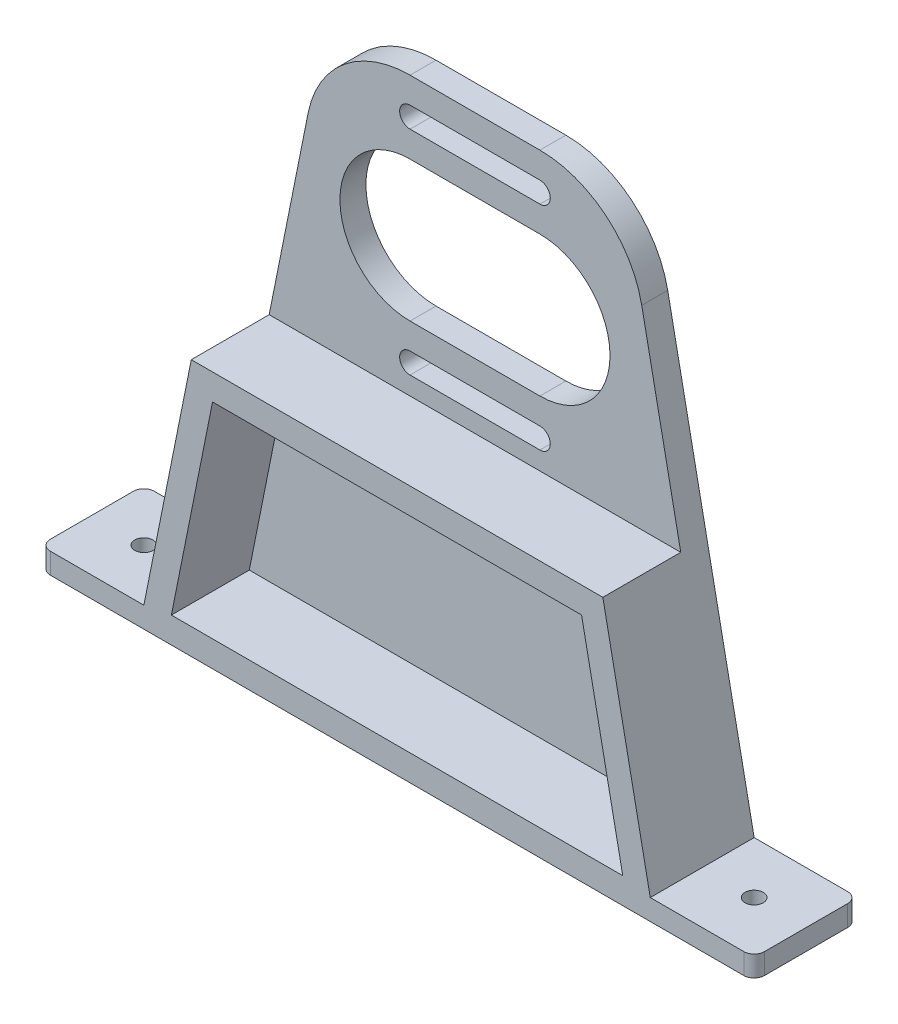
ISO-10303-21;
HEADER;
FILE_DESCRIPTION(('STEP AP214'),'2;1');
FILE_NAME('part.step','',(''),(''),'','','');
FILE_SCHEMA(('AUTOMOTIVE_DESIGN { 1 0 10303 214 1 1 1 1 }'));
ENDSEC;
DATA;
#1=APPLICATION_CONTEXT('core data for automotive mechanical design processes');
#2=APPLICATION_PROTOCOL_DEFINITION('international standard','automotive_design',2000,#1);
#3=PRODUCT_CONTEXT('',#1,'mechanical');
#4=PRODUCT('Part','Part','',(#3));
#5=PRODUCT_RELATED_PRODUCT_CATEGORY('part','',(#4));
#6=PRODUCT_DEFINITION_FORMATION('','',#4);
#7=PRODUCT_DEFINITION_CONTEXT('part definition',#1,'design');
#8=PRODUCT_DEFINITION('design','',#6,#7);
#9=PRODUCT_DEFINITION_SHAPE('','',#8);
#10=(LENGTH_UNIT() NAMED_UNIT(*) SI_UNIT(.MILLI.,.METRE.));
#11=(NAMED_UNIT(*) PLANE_ANGLE_UNIT() SI_UNIT($,.RADIAN.));
#12=(NAMED_UNIT(*) SI_UNIT($,.STERADIAN.) SOLID_ANGLE_UNIT());
#13=UNCERTAINTY_MEASURE_WITH_UNIT(LENGTH_MEASURE(1.E-05),#10,'distance_accuracy_value','');
#14=(GEOMETRIC_REPRESENTATION_CONTEXT(3) GLOBAL_UNCERTAINTY_ASSIGNED_CONTEXT((#13)) GLOBAL_UNIT_ASSIGNED_CONTEXT((#10,
#11,#12)) REPRESENTATION_CONTEXT('',''));
#15=CARTESIAN_POINT('',(0.,0.,0.));
#16=DIRECTION('',(0.,0.,1.));
#17=DIRECTION('',(1.,0.,0.));
#18=AXIS2_PLACEMENT_3D('',#15,#16,#17);
#19=CARTESIAN_POINT('',(-12.5,83.,5.));
#20=DIRECTION('',(0.,0.,-1.));
#21=DIRECTION('',(-1.,0.,0.));
#22=AXIS2_PLACEMENT_3D('',#19,#20,#21);
#23=PLANE('',#22);
#24=CARTESIAN_POINT('',(-12.5,75.5,5.));
#25=DIRECTION('',(0.,0.,1.));
#26=DIRECTION('',(1.,0.,0.));
#27=AXIS2_PLACEMENT_3D('',#24,#25,#26);
#28=CIRCLE('',#27,13.5);
#29=CARTESIAN_POINT('',(-12.5,89.,5.));
#30=VERTEX_POINT('',#29);
#31=CARTESIAN_POINT('',(-12.5,62.,5.));
#32=VERTEX_POINT('',#31);
#33=EDGE_CURVE('E351',#30,#32,#28,.T.);
#34=ORIENTED_EDGE('',*,*,#33,.F.);
#35=DIRECTION('',(-1.,0.,0.));
#36=VECTOR('',#35,1.);
#37=CARTESIAN_POINT('',(-12.5,89.,5.));
#38=LINE('',#37,#36);
#39=CARTESIAN_POINT('',(12.5,89.,5.));
#40=VERTEX_POINT('',#39);
#41=EDGE_CURVE('E362',#40,#30,#38,.T.);
#42=ORIENTED_EDGE('',*,*,#41,.F.);
#43=CARTESIAN_POINT('',(12.5,75.5,5.));
#44=DIRECTION('',(0.,0.,1.));
#45=DIRECTION('',(1.,0.,0.));
#46=AXIS2_PLACEMENT_3D('',#43,#44,#45);
#47=CIRCLE('',#46,13.5);
#48=CARTESIAN_POINT('',(12.5,62.,5.));
#49=VERTEX_POINT('',#48);
#50=EDGE_CURVE('E358',#49,#40,#47,.T.);
#51=ORIENTED_EDGE('',*,*,#50,.F.);
#52=DIRECTION('',(1.,0.,0.));
#53=VECTOR('',#52,1.);
#54=CARTESIAN_POINT('',(-12.5,62.,5.));
#55=LINE('',#54,#53);
#56=EDGE_CURVE('E354',#32,#49,#55,.T.);
#57=ORIENTED_EDGE('',*,*,#56,.F.);
#58=EDGE_LOOP('',(#34,#42,#51,#57));
#59=FACE_BOUND('',#58,.T.);
#60=CARTESIAN_POINT('',(-12.5,96.,5.));
#61=DIRECTION('',(0.,0.,1.));
#62=DIRECTION('',(1.,0.,0.));
#63=AXIS2_PLACEMENT_3D('',#60,#61,#62);
#64=CIRCLE('',#63,2.);
#65=CARTESIAN_POINT('',(-12.5,98.,5.));
#66=VERTEX_POINT('',#65);
#67=CARTESIAN_POINT('',(-12.5,94.,5.));
#68=VERTEX_POINT('',#67);
#69=EDGE_CURVE('E394',#66,#68,#64,.T.);
#70=ORIENTED_EDGE('',*,*,#69,.F.);
#71=DIRECTION('',(-1.,0.,0.));
#72=VECTOR('',#71,1.);
#73=CARTESIAN_POINT('',(-12.5,98.,5.));
#74=LINE('',#73,#72);
#75=CARTESIAN_POINT('',(12.5,98.,5.));
#76=VERTEX_POINT('',#75);
#77=EDGE_CURVE('E405',#76,#66,#74,.T.);
#78=ORIENTED_EDGE('',*,*,#77,.F.);
#79=CARTESIAN_POINT('',(12.5,96.,5.));
#80=DIRECTION('',(0.,0.,1.));
#81=DIRECTION('',(1.,0.,0.));
#82=AXIS2_PLACEMENT_3D('',#79,#80,#81);
#83=CIRCLE('',#82,2.);
#84=CARTESIAN_POINT('',(12.5,94.,5.));
#85=VERTEX_POINT('',#84);
#86=EDGE_CURVE('E401',#85,#76,#83,.T.);
#87=ORIENTED_EDGE('',*,*,#86,.F.);
#88=DIRECTION('',(1.,0.,0.));
#89=VECTOR('',#88,1.);
#90=CARTESIAN_POINT('',(-12.5,94.,5.));
#91=LINE('',#90,#89);
#92=EDGE_CURVE('E397',#68,#85,#91,.T.);
#93=ORIENTED_EDGE('',*,*,#92,.F.);
#94=EDGE_LOOP('',(#70,#78,#87,#93));
#95=FACE_BOUND('',#94,.T.);
#96=CARTESIAN_POINT('',(-12.5,55.,5.));
#97=DIRECTION('',(0.,0.,1.));
#98=DIRECTION('',(1.,0.,0.));
#99=AXIS2_PLACEMENT_3D('',#96,#97,#98);
#100=CIRCLE('',#99,2.);
#101=CARTESIAN_POINT('',(-12.5,57.,5.));
#102=VERTEX_POINT('',#101);
#103=CARTESIAN_POINT('',(-12.5,53.,5.));
#104=VERTEX_POINT('',#103);
#105=EDGE_CURVE('E308',#102,#104,#100,.T.);
#106=ORIENTED_EDGE('',*,*,#105,.F.);
#107=DIRECTION('',(-1.,0.,0.));
#108=VECTOR('',#107,1.);
#109=CARTESIAN_POINT('',(-12.5,57.,5.));
#110=LINE('',#109,#108);
#111=CARTESIAN_POINT('',(12.5,57.,5.));
#112=VERTEX_POINT('',#111);
#113=EDGE_CURVE('E319',#112,#102,#110,.T.);
#114=ORIENTED_EDGE('',*,*,#113,.F.);
#115=CARTESIAN_POINT('',(12.5,55.,5.));
#116=DIRECTION('',(0.,0.,1.));
#117=DIRECTION('',(1.,0.,0.));
#118=AXIS2_PLACEMENT_3D('',#115,#116,#117);
#119=CIRCLE('',#118,2.);
#120=CARTESIAN_POINT('',(12.5,53.,5.));
#121=VERTEX_POINT('',#120);
#122=EDGE_CURVE('E315',#121,#112,#119,.T.);
#123=ORIENTED_EDGE('',*,*,#122,.F.);
#124=DIRECTION('',(1.,0.,0.));
#125=VECTOR('',#124,1.);
#126=CARTESIAN_POINT('',(-12.5,53.,5.));
#127=LINE('',#126,#125);
#128=EDGE_CURVE('E311',#104,#121,#127,.T.);
#129=ORIENTED_EDGE('',*,*,#128,.F.);
#130=EDGE_LOOP('',(#106,#114,#123,#129));
#131=FACE_BOUND('',#130,.T.);
#132=DIRECTION('',(-1.,0.,0.));
#133=VECTOR('',#132,1.);
#134=CARTESIAN_POINT('',(-39.6204148763501,49.5,5.));
#135=LINE('',#134,#133);
#136=CARTESIAN_POINT('',(39.6204148763502,49.5,5.));
#137=VERTEX_POINT('',#136);
#138=CARTESIAN_POINT('',(-39.6204148763501,49.5,5.));
#139=VERTEX_POINT('',#138);
#140=EDGE_CURVE('E295',#137,#139,#135,.T.);
#141=ORIENTED_EDGE('',*,*,#140,.F.);
#142=DIRECTION('',(-0.196729092755028,0.980457884900613,0.));
#143=VECTOR('',#142,1.);
#144=CARTESIAN_POINT('',(32.1091576980123,86.9345818551006,5.));
#145=LINE('',#144,#143);
#146=CARTESIAN_POINT('',(32.1091576980123,86.9345818551006,5.));
#147=VERTEX_POINT('',#146);
#148=EDGE_CURVE('E437',#137,#147,#145,.T.);
#149=ORIENTED_EDGE('',*,*,#148,.T.);
#150=CARTESIAN_POINT('',(12.5,83.,5.));
#151=DIRECTION('',(0.,0.,1.));
#152=DIRECTION('',(-1.,0.,0.));
#153=AXIS2_PLACEMENT_3D('',#150,#151,#152);
#154=CIRCLE('',#153,20.);
#155=CARTESIAN_POINT('',(12.5,103.,5.));
#156=VERTEX_POINT('',#155);
#157=EDGE_CURVE('E440',#147,#156,#154,.T.);
#158=ORIENTED_EDGE('',*,*,#157,.T.);
#159=DIRECTION('',(-1.,0.,0.));
#160=VECTOR('',#159,1.);
#161=CARTESIAN_POINT('',(-12.5,103.,5.));
#162=LINE('',#161,#160);
#163=CARTESIAN_POINT('',(-12.5,103.,5.));
#164=VERTEX_POINT('',#163);
#165=EDGE_CURVE('E444',#156,#164,#162,.T.);
#166=ORIENTED_EDGE('',*,*,#165,.T.);
#167=CARTESIAN_POINT('',(-12.5,83.,5.));
#168=DIRECTION('',(0.,0.,1.));
#169=DIRECTION('',(-1.,0.,0.));
#170=AXIS2_PLACEMENT_3D('',#167,#168,#169);
#171=CIRCLE('',#170,20.);
#172=CARTESIAN_POINT('',(-32.1091576980123,86.9345818551006,5.));
#173=VERTEX_POINT('',#172);
#174=EDGE_CURVE('E447',#164,#173,#171,.T.);
#175=ORIENTED_EDGE('',*,*,#174,.T.);
#176=DIRECTION('',(-0.196729092755028,-0.980457884900613,0.));
#177=VECTOR('',#176,1.);
#178=CARTESIAN_POINT('',(-48.75,4.,5.));
#179=LINE('',#178,#177);
#180=EDGE_CURVE('E450',#173,#139,#179,.T.);
#181=ORIENTED_EDGE('',*,*,#180,.T.);
#182=EDGE_LOOP('',(#141,#149,#158,#166,#175,#181));
#183=FACE_BOUND('',#182,.T.);
#184=ADVANCED_FACE('F43',(#59,#95,#131,#183),#23,.F.);
#185=CARTESIAN_POINT('',(-12.5,83.,0.));
#186=DIRECTION('',(0.,0.,-1.));
#187=DIRECTION('',(-1.,0.,0.));
#188=AXIS2_PLACEMENT_3D('',#185,#186,#187);
#189=PLANE('',#188);
#190=DIRECTION('',(1.,0.,0.));
#191=VECTOR('',#190,1.);
#192=CARTESIAN_POINT('',(-68.75,0.,0.));
#193=LINE('',#192,#191);
#194=CARTESIAN_POINT('',(-66.75,0.,0.));
#195=VERTEX_POINT('',#194);
#196=CARTESIAN_POINT('',(66.75,0.,0.));
#197=VERTEX_POINT('',#196);
#198=EDGE_CURVE('E436',#195,#197,#193,.T.);
#199=ORIENTED_EDGE('',*,*,#198,.F.);
#200=DIRECTION('',(0.,-1.,0.));
#201=VECTOR('',#200,1.);
#202=CARTESIAN_POINT('',(-66.75,4.00000000000001,0.));
#203=LINE('',#202,#201);
#204=CARTESIAN_POINT('',(-66.75,4.,0.));
#205=VERTEX_POINT('',#204);
#206=EDGE_CURVE('E12',#195,#205,#203,.F.);
#207=ORIENTED_EDGE('',*,*,#206,.T.);
#208=DIRECTION('',(-1.,0.,0.));
#209=VECTOR('',#208,1.);
#210=CARTESIAN_POINT('',(-68.75,4.,0.));
#211=LINE('',#210,#209);
#212=CARTESIAN_POINT('',(-48.75,4.,0.));
#213=VERTEX_POINT('',#212);
#214=EDGE_CURVE('E441',#213,#205,#211,.T.);
#215=ORIENTED_EDGE('',*,*,#214,.F.);
#216=DIRECTION('',(-0.196729092755028,-0.980457884900613,0.));
#217=VECTOR('',#216,1.);
#218=CARTESIAN_POINT('',(-48.75,4.,0.));
#219=LINE('',#218,#217);
#220=CARTESIAN_POINT('',(-32.1091576980123,86.9345818551006,0.));
#221=VERTEX_POINT('',#220);
#222=EDGE_CURVE('E471',#221,#213,#219,.T.);
#223=ORIENTED_EDGE('',*,*,#222,.F.);
#224=CARTESIAN_POINT('',(-12.5,83.,0.));
#225=DIRECTION('',(0.,0.,1.));
#226=DIRECTION('',(-1.,0.,0.));
#227=AXIS2_PLACEMENT_3D('',#224,#225,#226);
#228=CIRCLE('',#227,20.);
#229=CARTESIAN_POINT('',(-12.5,103.,0.));
#230=VERTEX_POINT('',#229);
#231=EDGE_CURVE('E468',#230,#221,#228,.T.);
#232=ORIENTED_EDGE('',*,*,#231,.F.);
#233=DIRECTION('',(-1.,0.,0.));
#234=VECTOR('',#233,1.);
#235=CARTESIAN_POINT('',(-12.5,103.,0.));
#236=LINE('',#235,#234);
#237=CARTESIAN_POINT('',(12.5,103.,0.));
#238=VERTEX_POINT('',#237);
#239=EDGE_CURVE('E465',#238,#230,#236,.T.);
#240=ORIENTED_EDGE('',*,*,#239,.F.);
#241=CARTESIAN_POINT('',(12.5,83.,0.));
#242=DIRECTION('',(0.,0.,1.));
#243=DIRECTION('',(-1.,0.,0.));
#244=AXIS2_PLACEMENT_3D('',#241,#242,#243);
#245=CIRCLE('',#244,20.);
#246=CARTESIAN_POINT('',(32.1091576980123,86.9345818551006,0.));
#247=VERTEX_POINT('',#246);
#248=EDGE_CURVE('E462',#247,#238,#245,.T.);
#249=ORIENTED_EDGE('',*,*,#248,.F.);
#250=DIRECTION('',(-0.196729092755028,0.980457884900613,0.));
#251=VECTOR('',#250,1.);
#252=CARTESIAN_POINT('',(32.1091576980123,86.9345818551006,0.));
#253=LINE('',#252,#251);
#254=CARTESIAN_POINT('',(48.75,4.,0.));
#255=VERTEX_POINT('',#254);
#256=EDGE_CURVE('E459',#255,#247,#253,.T.);
#257=ORIENTED_EDGE('',*,*,#256,.F.);
#258=DIRECTION('',(-1.,0.,0.));
#259=VECTOR('',#258,1.);
#260=CARTESIAN_POINT('',(48.75,4.,0.));
#261=LINE('',#260,#259);
#262=CARTESIAN_POINT('',(66.75,4.,0.));
#263=VERTEX_POINT('',#262);
#264=EDGE_CURVE('E260',#263,#255,#261,.T.);
#265=ORIENTED_EDGE('',*,*,#264,.F.);
#266=DIRECTION('',(0.,1.,0.));
#267=VECTOR('',#266,1.);
#268=CARTESIAN_POINT('',(66.75,0.,0.));
#269=LINE('',#268,#267);
#270=EDGE_CURVE('E52',#263,#197,#269,.F.);
#271=ORIENTED_EDGE('',*,*,#270,.T.);
#272=EDGE_LOOP('',(#199,#207,#215,#223,#232,#240,#249,#257,#265,#271));
#273=FACE_BOUND('',#272,.T.);
#274=DIRECTION('',(-1.,0.,0.));
#275=VECTOR('',#274,1.);
#276=CARTESIAN_POINT('',(-12.5,98.,0.));
#277=LINE('',#276,#275);
#278=CARTESIAN_POINT('',(12.5,98.,0.));
#279=VERTEX_POINT('',#278);
#280=CARTESIAN_POINT('',(-12.5,98.,0.));
#281=VERTEX_POINT('',#280);
#282=EDGE_CURVE('E398',#279,#281,#277,.T.);
#283=ORIENTED_EDGE('',*,*,#282,.T.);
#284=CARTESIAN_POINT('',(-12.5,96.,0.));
#285=DIRECTION('',(0.,0.,1.));
#286=DIRECTION('',(1.,0.,0.));
#287=AXIS2_PLACEMENT_3D('',#284,#285,#286);
#288=CIRCLE('',#287,2.);
#289=CARTESIAN_POINT('',(-12.5,94.,0.));
#290=VERTEX_POINT('',#289);
#291=EDGE_CURVE('E393',#281,#290,#288,.T.);
#292=ORIENTED_EDGE('',*,*,#291,.T.);
#293=DIRECTION('',(1.,0.,0.));
#294=VECTOR('',#293,1.);
#295=CARTESIAN_POINT('',(-12.5,94.,0.));
#296=LINE('',#295,#294);
#297=CARTESIAN_POINT('',(12.5,94.,0.));
#298=VERTEX_POINT('',#297);
#299=EDGE_CURVE('E412',#290,#298,#296,.T.);
#300=ORIENTED_EDGE('',*,*,#299,.T.);
#301=CARTESIAN_POINT('',(12.5,96.,0.));
#302=DIRECTION('',(0.,0.,1.));
#303=DIRECTION('',(1.,0.,0.));
#304=AXIS2_PLACEMENT_3D('',#301,#302,#303);
#305=CIRCLE('',#304,2.);
#306=EDGE_CURVE('E416',#298,#279,#305,.T.);
#307=ORIENTED_EDGE('',*,*,#306,.T.);
#308=EDGE_LOOP('',(#283,#292,#300,#307));
#309=FACE_BOUND('',#308,.T.);
#310=DIRECTION('',(-1.,0.,0.));
#311=VECTOR('',#310,1.);
#312=CARTESIAN_POINT('',(-12.5,89.,0.));
#313=LINE('',#312,#311);
#314=CARTESIAN_POINT('',(12.5,89.,0.));
#315=VERTEX_POINT('',#314);
#316=CARTESIAN_POINT('',(-12.5,89.,0.));
#317=VERTEX_POINT('',#316);
#318=EDGE_CURVE('E355',#315,#317,#313,.T.);
#319=ORIENTED_EDGE('',*,*,#318,.T.);
#320=CARTESIAN_POINT('',(-12.5,75.5,0.));
#321=DIRECTION('',(0.,0.,1.));
#322=DIRECTION('',(1.,0.,0.));
#323=AXIS2_PLACEMENT_3D('',#320,#321,#322);
#324=CIRCLE('',#323,13.5);
#325=CARTESIAN_POINT('',(-12.5,62.,0.));
#326=VERTEX_POINT('',#325);
#327=EDGE_CURVE('E350',#317,#326,#324,.T.);
#328=ORIENTED_EDGE('',*,*,#327,.T.);
#329=DIRECTION('',(1.,0.,0.));
#330=VECTOR('',#329,1.);
#331=CARTESIAN_POINT('',(-12.5,62.,0.));
#332=LINE('',#331,#330);
#333=CARTESIAN_POINT('',(12.5,62.,0.));
#334=VERTEX_POINT('',#333);
#335=EDGE_CURVE('E369',#326,#334,#332,.T.);
#336=ORIENTED_EDGE('',*,*,#335,.T.);
#337=CARTESIAN_POINT('',(12.5,75.5,0.));
#338=DIRECTION('',(0.,0.,1.));
#339=DIRECTION('',(1.,0.,0.));
#340=AXIS2_PLACEMENT_3D('',#337,#338,#339);
#341=CIRCLE('',#340,13.5);
#342=EDGE_CURVE('E373',#334,#315,#341,.T.);
#343=ORIENTED_EDGE('',*,*,#342,.T.);
#344=EDGE_LOOP('',(#319,#328,#336,#343));
#345=FACE_BOUND('',#344,.T.);
#346=DIRECTION('',(-1.,0.,0.));
#347=VECTOR('',#346,1.);
#348=CARTESIAN_POINT('',(-12.5,57.,0.));
#349=LINE('',#348,#347);
#350=CARTESIAN_POINT('',(12.5,57.,0.));
#351=VERTEX_POINT('',#350);
#352=CARTESIAN_POINT('',(-12.5,57.,0.));
#353=VERTEX_POINT('',#352);
#354=EDGE_CURVE('E312',#351,#353,#349,.T.);
#355=ORIENTED_EDGE('',*,*,#354,.T.);
#356=CARTESIAN_POINT('',(-12.5,55.,0.));
#357=DIRECTION('',(0.,0.,1.));
#358=DIRECTION('',(1.,0.,0.));
#359=AXIS2_PLACEMENT_3D('',#356,#357,#358);
#360=CIRCLE('',#359,2.);
#361=CARTESIAN_POINT('',(-12.5,53.,0.));
#362=VERTEX_POINT('',#361);
#363=EDGE_CURVE('E304',#353,#362,#360,.T.);
#364=ORIENTED_EDGE('',*,*,#363,.T.);
#365=DIRECTION('',(1.,0.,0.));
#366=VECTOR('',#365,1.);
#367=CARTESIAN_POINT('',(-12.5,53.,0.));
#368=LINE('',#367,#366);
#369=CARTESIAN_POINT('',(12.5,53.,0.));
#370=VERTEX_POINT('',#369);
#371=EDGE_CURVE('E326',#362,#370,#368,.T.);
#372=ORIENTED_EDGE('',*,*,#371,.T.);
#373=CARTESIAN_POINT('',(12.5,55.,0.));
#374=DIRECTION('',(0.,0.,1.));
#375=DIRECTION('',(1.,0.,0.));
#376=AXIS2_PLACEMENT_3D('',#373,#374,#375);
#377=CIRCLE('',#376,2.);
#378=EDGE_CURVE('E330',#370,#351,#377,.T.);
#379=ORIENTED_EDGE('',*,*,#378,.T.);
#380=EDGE_LOOP('',(#355,#364,#372,#379));
#381=FACE_BOUND('',#380,.T.);
#382=ADVANCED_FACE('F553',(#273,#309,#345,#381),#189,.T.);
#383=CARTESIAN_POINT('',(-68.75,0.,5.));
#384=DIRECTION('',(1.,0.,0.));
#385=DIRECTION('',(0.,1.,0.));
#386=AXIS2_PLACEMENT_3D('',#383,#384,#385);
#387=PLANE('',#386);
#388=DIRECTION('',(0.,0.,-1.));
#389=VECTOR('',#388,1.);
#390=CARTESIAN_POINT('',(-68.75,0.,5.));
#391=LINE('',#390,#389);
#392=CARTESIAN_POINT('',(-68.75,0.,18.));
#393=VERTEX_POINT('',#392);
#394=CARTESIAN_POINT('',(-68.75,0.,2.));
#395=VERTEX_POINT('',#394);
#396=EDGE_CURVE('E504',#393,#395,#391,.T.);
#397=ORIENTED_EDGE('',*,*,#396,.F.);
#398=DIRECTION('',(0.,1.,0.));
#399=VECTOR('',#398,1.);
#400=CARTESIAN_POINT('',(-68.75,0.,18.));
#401=LINE('',#400,#399);
#402=CARTESIAN_POINT('',(-68.75,4.,18.));
#403=VERTEX_POINT('',#402);
#404=EDGE_CURVE('E543',#393,#403,#401,.T.);
#405=ORIENTED_EDGE('',*,*,#404,.T.);
#406=DIRECTION('',(0.,0.,-1.));
#407=VECTOR('',#406,1.);
#408=CARTESIAN_POINT('',(-68.75,4.,5.));
#409=LINE('',#408,#407);
#410=CARTESIAN_POINT('',(-68.75,4.,2.));
#411=VERTEX_POINT('',#410);
#412=EDGE_CURVE('E453',#403,#411,#409,.T.);
#413=ORIENTED_EDGE('',*,*,#412,.T.);
#414=DIRECTION('',(0.,-1.,0.));
#415=VECTOR('',#414,1.);
#416=CARTESIAN_POINT('',(-68.75,0.,2.));
#417=LINE('',#416,#415);
#418=EDGE_CURVE('E539',#411,#395,#417,.T.);
#419=ORIENTED_EDGE('',*,*,#418,.T.);
#420=EDGE_LOOP('',(#397,#405,#413,#419));
#421=FACE_BOUND('',#420,.T.);
#422=ADVANCED_FACE('F649',(#421),#387,.F.);
#423=CARTESIAN_POINT('',(-68.75,0.,5.));
#424=DIRECTION('',(0.,1.,0.));
#425=DIRECTION('',(0.,0.,1.));
#426=AXIS2_PLACEMENT_3D('',#423,#424,#425);
#427=PLANE('',#426);
#428=CARTESIAN_POINT('',(-58.75,0.,10.));
#429=DIRECTION('',(0.,1.,0.));
#430=DIRECTION('',(0.,0.,1.));
#431=AXIS2_PLACEMENT_3D('',#428,#429,#430);
#432=CIRCLE('',#431,1.75);
#433=CARTESIAN_POINT('',(-58.75,0.,11.75));
#434=VERTEX_POINT('',#433);
#435=EDGE_CURVE('E601',#434,#434,#432,.T.);
#436=ORIENTED_EDGE('',*,*,#435,.T.);
#437=EDGE_LOOP('',(#436));
#438=FACE_BOUND('',#437,.T.);
#439=CARTESIAN_POINT('',(58.75,0.,9.99999999999999));
#440=DIRECTION('',(0.,1.,0.));
#441=DIRECTION('',(0.,0.,1.));
#442=AXIS2_PLACEMENT_3D('',#439,#440,#441);
#443=CIRCLE('',#442,1.75);
#444=CARTESIAN_POINT('',(58.75,0.,11.75));
#445=VERTEX_POINT('',#444);
#446=EDGE_CURVE('E619',#445,#445,#443,.T.);
#447=ORIENTED_EDGE('',*,*,#446,.T.);
#448=EDGE_LOOP('',(#447));
#449=FACE_BOUND('',#448,.T.);
#450=DIRECTION('',(0.,0.,-1.));
#451=VECTOR('',#450,1.);
#452=CARTESIAN_POINT('',(68.75,0.,5.));
#453=LINE('',#452,#451);
#454=CARTESIAN_POINT('',(68.75,0.,18.));
#455=VERTEX_POINT('',#454);
#456=CARTESIAN_POINT('',(68.75,0.,2.));
#457=VERTEX_POINT('',#456);
#458=EDGE_CURVE('E500',#455,#457,#453,.T.);
#459=ORIENTED_EDGE('',*,*,#458,.F.);
#460=CARTESIAN_POINT('',(66.75,0.,18.));
#461=DIRECTION('',(0.,1.,0.));
#462=DIRECTION('',(0.,0.,1.));
#463=AXIS2_PLACEMENT_3D('',#460,#461,#462);
#464=CIRCLE('',#463,2.);
#465=CARTESIAN_POINT('',(66.75,0.,20.));
#466=VERTEX_POINT('',#465);
#467=EDGE_CURVE('E525',#455,#466,#464,.F.);
#468=ORIENTED_EDGE('',*,*,#467,.T.);
#469=DIRECTION('',(-1.,0.,0.));
#470=VECTOR('',#469,1.);
#471=CARTESIAN_POINT('',(-68.75,0.,20.));
#472=LINE('',#471,#470);
#473=CARTESIAN_POINT('',(-66.75,0.,20.));
#474=VERTEX_POINT('',#473);
#475=EDGE_CURVE('E276',#466,#474,#472,.T.);
#476=ORIENTED_EDGE('',*,*,#475,.T.);
#477=CARTESIAN_POINT('',(-66.75,0.,18.));
#478=DIRECTION('',(0.,1.,0.));
#479=DIRECTION('',(0.,0.,1.));
#480=AXIS2_PLACEMENT_3D('',#477,#478,#479);
#481=CIRCLE('',#480,2.);
#482=EDGE_CURVE('E522',#474,#393,#481,.F.);
#483=ORIENTED_EDGE('',*,*,#482,.T.);
#484=ORIENTED_EDGE('',*,*,#396,.T.);
#485=CARTESIAN_POINT('',(-66.75,0.,2.));
#486=DIRECTION('',(0.,1.,0.));
#487=DIRECTION('',(0.,0.,1.));
#488=AXIS2_PLACEMENT_3D('',#485,#486,#487);
#489=CIRCLE('',#488,2.);
#490=EDGE_CURVE('E519',#395,#195,#489,.F.);
#491=ORIENTED_EDGE('',*,*,#490,.T.);
#492=ORIENTED_EDGE('',*,*,#198,.T.);
#493=CARTESIAN_POINT('',(66.75,0.,2.));
#494=DIRECTION('',(0.,1.,0.));
#495=DIRECTION('',(0.,0.,1.));
#496=AXIS2_PLACEMENT_3D('',#493,#494,#495);
#497=CIRCLE('',#496,2.);
#498=EDGE_CURVE('E516',#197,#457,#497,.F.);
#499=ORIENTED_EDGE('',*,*,#498,.T.);
#500=EDGE_LOOP('',(#459,#468,#476,#483,#484,#491,#492,#499));
#501=FACE_BOUND('',#500,.T.);
#502=ADVANCED_FACE('F559',(#438,#449,#501),#427,.F.);
#503=CARTESIAN_POINT('',(68.75,4.,5.));
#504=DIRECTION('',(-1.,0.,0.));
#505=DIRECTION('',(0.,-1.,0.));
#506=AXIS2_PLACEMENT_3D('',#503,#504,#505);
#507=PLANE('',#506);
#508=DIRECTION('',(0.,0.,-1.));
#509=VECTOR('',#508,1.);
#510=CARTESIAN_POINT('',(68.75,4.,5.));
#511=LINE('',#510,#509);
#512=CARTESIAN_POINT('',(68.75,4.,18.));
#513=VERTEX_POINT('',#512);
#514=CARTESIAN_POINT('',(68.75,4.,2.));
#515=VERTEX_POINT('',#514);
#516=EDGE_CURVE('E265',#513,#515,#511,.T.);
#517=ORIENTED_EDGE('',*,*,#516,.F.);
#518=DIRECTION('',(0.,-1.,0.));
#519=VECTOR('',#518,1.);
#520=CARTESIAN_POINT('',(68.75,4.,18.));
#521=LINE('',#520,#519);
#522=EDGE_CURVE('E512',#513,#455,#521,.T.);
#523=ORIENTED_EDGE('',*,*,#522,.T.);
#524=ORIENTED_EDGE('',*,*,#458,.T.);
#525=DIRECTION('',(0.,1.,0.));
#526=VECTOR('',#525,1.);
#527=CARTESIAN_POINT('',(68.75,4.,2.));
#528=LINE('',#527,#526);
#529=EDGE_CURVE('E508',#457,#515,#528,.T.);
#530=ORIENTED_EDGE('',*,*,#529,.T.);
#531=EDGE_LOOP('',(#517,#523,#524,#530));
#532=FACE_BOUND('',#531,.T.);
#533=ADVANCED_FACE('F563',(#532),#507,.F.);
#534=CARTESIAN_POINT('',(48.75,4.,5.));
#535=DIRECTION('',(0.,-1.,0.));
#536=DIRECTION('',(0.,0.,-1.));
#537=AXIS2_PLACEMENT_3D('',#534,#535,#536);
#538=PLANE('',#537);
#539=CARTESIAN_POINT('',(58.75,4.,9.99999999999999));
#540=DIRECTION('',(0.,1.,0.));
#541=DIRECTION('',(0.,0.,1.));
#542=AXIS2_PLACEMENT_3D('',#539,#540,#541);
#543=CIRCLE('',#542,1.75);
#544=CARTESIAN_POINT('',(58.75,4.,11.75));
#545=VERTEX_POINT('',#544);
#546=EDGE_CURVE('E615',#545,#545,#543,.T.);
#547=ORIENTED_EDGE('',*,*,#546,.F.);
#548=EDGE_LOOP('',(#547));
#549=FACE_BOUND('',#548,.T.);
#550=DIRECTION('',(1.,0.,0.));
#551=VECTOR('',#550,1.);
#552=CARTESIAN_POINT('',(68.75,4.,20.));
#553=LINE('',#552,#551);
#554=CARTESIAN_POINT('',(48.75,4.,20.));
#555=VERTEX_POINT('',#554);
#556=CARTESIAN_POINT('',(66.75,4.,20.));
#557=VERTEX_POINT('',#556);
#558=EDGE_CURVE('E257',#555,#557,#553,.T.);
#559=ORIENTED_EDGE('',*,*,#558,.T.);
#560=CARTESIAN_POINT('',(66.75,4.,18.));
#561=DIRECTION('',(0.,-1.,0.));
#562=DIRECTION('',(0.,0.,-1.));
#563=AXIS2_PLACEMENT_3D('',#560,#561,#562);
#564=CIRCLE('',#563,2.);
#565=EDGE_CURVE('E536',#557,#513,#564,.F.);
#566=ORIENTED_EDGE('',*,*,#565,.T.);
#567=ORIENTED_EDGE('',*,*,#516,.T.);
#568=CARTESIAN_POINT('',(66.75,4.,2.));
#569=DIRECTION('',(0.,-1.,0.));
#570=DIRECTION('',(0.,0.,-1.));
#571=AXIS2_PLACEMENT_3D('',#568,#569,#570);
#572=CIRCLE('',#571,2.);
#573=EDGE_CURVE('E533',#515,#263,#572,.F.);
#574=ORIENTED_EDGE('',*,*,#573,.T.);
#575=ORIENTED_EDGE('',*,*,#264,.T.);
#576=DIRECTION('',(0.,0.,-1.));
#577=VECTOR('',#576,1.);
#578=CARTESIAN_POINT('',(48.75,4.,5.));
#579=LINE('',#578,#577);
#580=EDGE_CURVE('E254',#555,#255,#579,.T.);
#581=ORIENTED_EDGE('',*,*,#580,.F.);
#582=EDGE_LOOP('',(#559,#566,#567,#574,#575,#581));
#583=FACE_BOUND('',#582,.T.);
#584=ADVANCED_FACE('F256',(#549,#583),#538,.F.);
#585=CARTESIAN_POINT('',(32.1091576980123,86.9345818551006,5.));
#586=DIRECTION('',(-0.980457884900613,-0.196729092755028,0.));
#587=DIRECTION('',(0.196729092755028,-0.980457884900613,0.));
#588=AXIS2_PLACEMENT_3D('',#585,#586,#587);
#589=PLANE('',#588);
#590=ORIENTED_EDGE('',*,*,#256,.T.);
#591=DIRECTION('',(0.,0.,-1.));
#592=VECTOR('',#591,1.);
#593=CARTESIAN_POINT('',(32.1091576980123,86.9345818551006,5.));
#594=LINE('',#593,#592);
#595=EDGE_CURVE('E266',#147,#247,#594,.T.);
#596=ORIENTED_EDGE('',*,*,#595,.F.);
#597=ORIENTED_EDGE('',*,*,#148,.F.);
#598=DIRECTION('',(0.,0.,-1.));
#599=VECTOR('',#598,1.);
#600=CARTESIAN_POINT('',(39.6204148763502,49.5,186.138632811451));
#601=LINE('',#600,#599);
#602=CARTESIAN_POINT('',(39.6204148763502,49.5,20.));
#603=VERTEX_POINT('',#602);
#604=EDGE_CURVE('E281',#603,#137,#601,.T.);
#605=ORIENTED_EDGE('',*,*,#604,.F.);
#606=DIRECTION('',(0.196729092755028,-0.980457884900613,0.));
#607=VECTOR('',#606,1.);
#608=CARTESIAN_POINT('',(48.75,4.,20.));
#609=LINE('',#608,#607);
#610=EDGE_CURVE('E271',#603,#555,#609,.T.);
#611=ORIENTED_EDGE('',*,*,#610,.T.);
#612=ORIENTED_EDGE('',*,*,#580,.T.);
#613=EDGE_LOOP('',(#590,#596,#597,#605,#611,#612));
#614=FACE_BOUND('',#613,.T.);
#615=ADVANCED_FACE('F278',(#614),#589,.F.);
#616=CARTESIAN_POINT('',(12.5,83.,5.));
#617=DIRECTION('',(0.,0.,-1.));
#618=DIRECTION('',(-1.,0.,0.));
#619=AXIS2_PLACEMENT_3D('',#616,#617,#618);
#620=CYLINDRICAL_SURFACE('',#619,20.);
#621=ORIENTED_EDGE('',*,*,#248,.T.);
#622=DIRECTION('',(0.,0.,-1.));
#623=VECTOR('',#622,1.);
#624=CARTESIAN_POINT('',(12.5,103.,5.));
#625=LINE('',#624,#623);
#626=EDGE_CURVE('E490',#156,#238,#625,.T.);
#627=ORIENTED_EDGE('',*,*,#626,.F.);
#628=ORIENTED_EDGE('',*,*,#157,.F.);
#629=ORIENTED_EDGE('',*,*,#595,.T.);
#630=EDGE_LOOP('',(#621,#627,#628,#629));
#631=FACE_BOUND('',#630,.T.);
#632=ADVANCED_FACE('F794',(#631),#620,.T.);
#633=CARTESIAN_POINT('',(-12.5,103.,5.));
#634=DIRECTION('',(0.,-1.,0.));
#635=DIRECTION('',(0.,0.,-1.));
#636=AXIS2_PLACEMENT_3D('',#633,#634,#635);
#637=PLANE('',#636);
#638=ORIENTED_EDGE('',*,*,#239,.T.);
#639=DIRECTION('',(0.,0.,-1.));
#640=VECTOR('',#639,1.);
#641=CARTESIAN_POINT('',(-12.5,103.,5.));
#642=LINE('',#641,#640);
#643=EDGE_CURVE('E486',#164,#230,#642,.T.);
#644=ORIENTED_EDGE('',*,*,#643,.F.);
#645=ORIENTED_EDGE('',*,*,#165,.F.);
#646=ORIENTED_EDGE('',*,*,#626,.T.);
#647=EDGE_LOOP('',(#638,#644,#645,#646));
#648=FACE_BOUND('',#647,.T.);
#649=ADVANCED_FACE('F791',(#648),#637,.F.);
#650=CARTESIAN_POINT('',(-12.5,83.,5.));
#651=DIRECTION('',(0.,0.,-1.));
#652=DIRECTION('',(-1.,0.,0.));
#653=AXIS2_PLACEMENT_3D('',#650,#651,#652);
#654=CYLINDRICAL_SURFACE('',#653,20.);
#655=ORIENTED_EDGE('',*,*,#231,.T.);
#656=DIRECTION('',(0.,0.,-1.));
#657=VECTOR('',#656,1.);
#658=CARTESIAN_POINT('',(-32.1091576980123,86.9345818551006,5.));
#659=LINE('',#658,#657);
#660=EDGE_CURVE('E482',#173,#221,#659,.T.);
#661=ORIENTED_EDGE('',*,*,#660,.F.);
#662=ORIENTED_EDGE('',*,*,#174,.F.);
#663=ORIENTED_EDGE('',*,*,#643,.T.);
#664=EDGE_LOOP('',(#655,#661,#662,#663));
#665=FACE_BOUND('',#664,.T.);
#666=ADVANCED_FACE('F786',(#665),#654,.T.);
#667=CARTESIAN_POINT('',(-48.75,4.,5.));
#668=DIRECTION('',(0.980457884900613,-0.196729092755028,0.));
#669=DIRECTION('',(0.196729092755028,0.980457884900613,0.));
#670=AXIS2_PLACEMENT_3D('',#667,#668,#669);
#671=PLANE('',#670);
#672=ORIENTED_EDGE('',*,*,#222,.T.);
#673=DIRECTION('',(0.,0.,-1.));
#674=VECTOR('',#673,1.);
#675=CARTESIAN_POINT('',(-48.75,4.,5.));
#676=LINE('',#675,#674);
#677=CARTESIAN_POINT('',(-48.75,4.,20.));
#678=VERTEX_POINT('',#677);
#679=EDGE_CURVE('E478',#678,#213,#676,.T.);
#680=ORIENTED_EDGE('',*,*,#679,.F.);
#681=DIRECTION('',(0.196729092755032,0.980457884900612,0.));
#682=VECTOR('',#681,1.);
#683=CARTESIAN_POINT('',(-39.6204148763501,49.5,20.));
#684=LINE('',#683,#682);
#685=CARTESIAN_POINT('',(-39.6204148763501,49.5,20.));
#686=VERTEX_POINT('',#685);
#687=EDGE_CURVE('E290',#678,#686,#684,.T.);
#688=ORIENTED_EDGE('',*,*,#687,.T.);
#689=DIRECTION('',(0.,0.,-1.));
#690=VECTOR('',#689,1.);
#691=CARTESIAN_POINT('',(-39.6204148763501,49.5,186.138632811451));
#692=LINE('',#691,#690);
#693=EDGE_CURVE('E294',#686,#139,#692,.T.);
#694=ORIENTED_EDGE('',*,*,#693,.T.);
#695=ORIENTED_EDGE('',*,*,#180,.F.);
#696=ORIENTED_EDGE('',*,*,#660,.T.);
#697=EDGE_LOOP('',(#672,#680,#688,#694,#695,#696));
#698=FACE_BOUND('',#697,.T.);
#699=ADVANCED_FACE('F644',(#698),#671,.F.);
#700=CARTESIAN_POINT('',(-68.75,4.,5.));
#701=DIRECTION('',(0.,-1.,0.));
#702=DIRECTION('',(0.,0.,-1.));
#703=AXIS2_PLACEMENT_3D('',#700,#701,#702);
#704=PLANE('',#703);
#705=CARTESIAN_POINT('',(-58.75,4.,10.));
#706=DIRECTION('',(0.,1.,0.));
#707=DIRECTION('',(0.,0.,1.));
#708=AXIS2_PLACEMENT_3D('',#705,#706,#707);
#709=CIRCLE('',#708,1.75);
#710=CARTESIAN_POINT('',(-58.75,4.,11.75));
#711=VERTEX_POINT('',#710);
#712=EDGE_CURVE('E623',#711,#711,#709,.T.);
#713=ORIENTED_EDGE('',*,*,#712,.F.);
#714=EDGE_LOOP('',(#713));
#715=FACE_BOUND('',#714,.T.);
#716=ORIENTED_EDGE('',*,*,#412,.F.);
#717=CARTESIAN_POINT('',(-66.75,4.,18.));
#718=DIRECTION('',(0.,-1.,0.));
#719=DIRECTION('',(0.,0.,-1.));
#720=AXIS2_PLACEMENT_3D('',#717,#718,#719);
#721=CIRCLE('',#720,2.);
#722=CARTESIAN_POINT('',(-66.75,4.,20.));
#723=VERTEX_POINT('',#722);
#724=EDGE_CURVE('E549',#403,#723,#721,.F.);
#725=ORIENTED_EDGE('',*,*,#724,.T.);
#726=DIRECTION('',(1.,0.,0.));
#727=VECTOR('',#726,1.);
#728=CARTESIAN_POINT('',(-48.75,4.,20.));
#729=LINE('',#728,#727);
#730=EDGE_CURVE('E572',#723,#678,#729,.T.);
#731=ORIENTED_EDGE('',*,*,#730,.T.);
#732=ORIENTED_EDGE('',*,*,#679,.T.);
#733=ORIENTED_EDGE('',*,*,#214,.T.);
#734=CARTESIAN_POINT('',(-66.75,4.,2.));
#735=DIRECTION('',(0.,-1.,0.));
#736=DIRECTION('',(0.,0.,-1.));
#737=AXIS2_PLACEMENT_3D('',#734,#735,#736);
#738=CIRCLE('',#737,2.);
#739=EDGE_CURVE('E64',#205,#411,#738,.F.);
#740=ORIENTED_EDGE('',*,*,#739,.T.);
#741=EDGE_LOOP('',(#716,#725,#731,#732,#733,#740));
#742=FACE_BOUND('',#741,.T.);
#743=ADVANCED_FACE('F641',(#715,#742),#704,.F.);
#744=CARTESIAN_POINT('',(-12.5,96.,5.));
#745=DIRECTION('',(0.,0.,-1.));
#746=DIRECTION('',(-1.,0.,0.));
#747=AXIS2_PLACEMENT_3D('',#744,#745,#746);
#748=CYLINDRICAL_SURFACE('',#747,2.);
#749=ORIENTED_EDGE('',*,*,#291,.F.);
#750=DIRECTION('',(0.,0.,-1.));
#751=VECTOR('',#750,1.);
#752=CARTESIAN_POINT('',(-12.5,98.,5.));
#753=LINE('',#752,#751);
#754=EDGE_CURVE('E408',#66,#281,#753,.T.);
#755=ORIENTED_EDGE('',*,*,#754,.F.);
#756=ORIENTED_EDGE('',*,*,#69,.T.);
#757=DIRECTION('',(0.,0.,-1.));
#758=VECTOR('',#757,1.);
#759=CARTESIAN_POINT('',(-12.5,94.,5.));
#760=LINE('',#759,#758);
#761=EDGE_CURVE('E432',#68,#290,#760,.T.);
#762=ORIENTED_EDGE('',*,*,#761,.T.);
#763=EDGE_LOOP('',(#749,#755,#756,#762));
#764=FACE_BOUND('',#763,.T.);
#765=ADVANCED_FACE('F643',(#764),#748,.F.);
#766=CARTESIAN_POINT('',(-12.5,94.,5.));
#767=DIRECTION('',(0.,1.,0.));
#768=DIRECTION('',(0.,0.,1.));
#769=AXIS2_PLACEMENT_3D('',#766,#767,#768);
#770=PLANE('',#769);
#771=ORIENTED_EDGE('',*,*,#299,.F.);
#772=ORIENTED_EDGE('',*,*,#761,.F.);
#773=ORIENTED_EDGE('',*,*,#92,.T.);
#774=DIRECTION('',(0.,0.,-1.));
#775=VECTOR('',#774,1.);
#776=CARTESIAN_POINT('',(12.5,94.,5.));
#777=LINE('',#776,#775);
#778=EDGE_CURVE('E429',#85,#298,#777,.T.);
#779=ORIENTED_EDGE('',*,*,#778,.T.);
#780=EDGE_LOOP('',(#771,#772,#773,#779));
#781=FACE_BOUND('',#780,.T.);
#782=ADVANCED_FACE('F749',(#781),#770,.T.);
#783=CARTESIAN_POINT('',(12.5,96.,5.));
#784=DIRECTION('',(0.,0.,-1.));
#785=DIRECTION('',(-1.,0.,0.));
#786=AXIS2_PLACEMENT_3D('',#783,#784,#785);
#787=CYLINDRICAL_SURFACE('',#786,2.);
#788=ORIENTED_EDGE('',*,*,#306,.F.);
#789=ORIENTED_EDGE('',*,*,#778,.F.);
#790=ORIENTED_EDGE('',*,*,#86,.T.);
#791=DIRECTION('',(0.,0.,-1.));
#792=VECTOR('',#791,1.);
#793=CARTESIAN_POINT('',(12.5,98.,5.));
#794=LINE('',#793,#792);
#795=EDGE_CURVE('E426',#76,#279,#794,.T.);
#796=ORIENTED_EDGE('',*,*,#795,.T.);
#797=EDGE_LOOP('',(#788,#789,#790,#796));
#798=FACE_BOUND('',#797,.T.);
#799=ADVANCED_FACE('F745',(#798),#787,.F.);
#800=CARTESIAN_POINT('',(-12.5,98.,5.));
#801=DIRECTION('',(0.,-1.,0.));
#802=DIRECTION('',(0.,0.,-1.));
#803=AXIS2_PLACEMENT_3D('',#800,#801,#802);
#804=PLANE('',#803);
#805=ORIENTED_EDGE('',*,*,#282,.F.);
#806=ORIENTED_EDGE('',*,*,#795,.F.);
#807=ORIENTED_EDGE('',*,*,#77,.T.);
#808=ORIENTED_EDGE('',*,*,#754,.T.);
#809=EDGE_LOOP('',(#805,#806,#807,#808));
#810=FACE_BOUND('',#809,.T.);
#811=ADVANCED_FACE('F741',(#810),#804,.T.);
#812=CARTESIAN_POINT('',(-12.5,75.5,5.));
#813=DIRECTION('',(0.,0.,-1.));
#814=DIRECTION('',(-1.,0.,0.));
#815=AXIS2_PLACEMENT_3D('',#812,#813,#814);
#816=CYLINDRICAL_SURFACE('',#815,13.5);
#817=ORIENTED_EDGE('',*,*,#327,.F.);
#818=DIRECTION('',(0.,0.,-1.));
#819=VECTOR('',#818,1.);
#820=CARTESIAN_POINT('',(-12.5,89.,5.));
#821=LINE('',#820,#819);
#822=EDGE_CURVE('E365',#30,#317,#821,.T.);
#823=ORIENTED_EDGE('',*,*,#822,.F.);
#824=ORIENTED_EDGE('',*,*,#33,.T.);
#825=DIRECTION('',(0.,0.,-1.));
#826=VECTOR('',#825,1.);
#827=CARTESIAN_POINT('',(-12.5,62.,5.));
#828=LINE('',#827,#826);
#829=EDGE_CURVE('E389',#32,#326,#828,.T.);
#830=ORIENTED_EDGE('',*,*,#829,.T.);
#831=EDGE_LOOP('',(#817,#823,#824,#830));
#832=FACE_BOUND('',#831,.T.);
#833=ADVANCED_FACE('F737',(#832),#816,.F.);
#834=CARTESIAN_POINT('',(-12.5,62.,5.));
#835=DIRECTION('',(0.,1.,0.));
#836=DIRECTION('',(0.,0.,1.));
#837=AXIS2_PLACEMENT_3D('',#834,#835,#836);
#838=PLANE('',#837);
#839=ORIENTED_EDGE('',*,*,#335,.F.);
#840=ORIENTED_EDGE('',*,*,#829,.F.);
#841=ORIENTED_EDGE('',*,*,#56,.T.);
#842=DIRECTION('',(0.,0.,-1.));
#843=VECTOR('',#842,1.);
#844=CARTESIAN_POINT('',(12.5,62.,5.));
#845=LINE('',#844,#843);
#846=EDGE_CURVE('E386',#49,#334,#845,.T.);
#847=ORIENTED_EDGE('',*,*,#846,.T.);
#848=EDGE_LOOP('',(#839,#840,#841,#847));
#849=FACE_BOUND('',#848,.T.);
#850=ADVANCED_FACE('F733',(#849),#838,.T.);
#851=CARTESIAN_POINT('',(12.5,75.5,5.));
#852=DIRECTION('',(0.,0.,-1.));
#853=DIRECTION('',(-1.,0.,0.));
#854=AXIS2_PLACEMENT_3D('',#851,#852,#853);
#855=CYLINDRICAL_SURFACE('',#854,13.5);
#856=ORIENTED_EDGE('',*,*,#342,.F.);
#857=ORIENTED_EDGE('',*,*,#846,.F.);
#858=ORIENTED_EDGE('',*,*,#50,.T.);
#859=DIRECTION('',(0.,0.,-1.));
#860=VECTOR('',#859,1.);
#861=CARTESIAN_POINT('',(12.5,89.,5.));
#862=LINE('',#861,#860);
#863=EDGE_CURVE('E383',#40,#315,#862,.T.);
#864=ORIENTED_EDGE('',*,*,#863,.T.);
#865=EDGE_LOOP('',(#856,#857,#858,#864));
#866=FACE_BOUND('',#865,.T.);
#867=ADVANCED_FACE('F729',(#866),#855,.F.);
#868=CARTESIAN_POINT('',(-12.5,89.,5.));
#869=DIRECTION('',(0.,-1.,0.));
#870=DIRECTION('',(0.,0.,-1.));
#871=AXIS2_PLACEMENT_3D('',#868,#869,#870);
#872=PLANE('',#871);
#873=ORIENTED_EDGE('',*,*,#318,.F.);
#874=ORIENTED_EDGE('',*,*,#863,.F.);
#875=ORIENTED_EDGE('',*,*,#41,.T.);
#876=ORIENTED_EDGE('',*,*,#822,.T.);
#877=EDGE_LOOP('',(#873,#874,#875,#876));
#878=FACE_BOUND('',#877,.T.);
#879=ADVANCED_FACE('F725',(#878),#872,.T.);
#880=CARTESIAN_POINT('',(-12.5,55.,5.));
#881=DIRECTION('',(0.,0.,-1.));
#882=DIRECTION('',(-1.,0.,0.));
#883=AXIS2_PLACEMENT_3D('',#880,#881,#882);
#884=CYLINDRICAL_SURFACE('',#883,2.);
#885=ORIENTED_EDGE('',*,*,#363,.F.);
#886=DIRECTION('',(0.,0.,-1.));
#887=VECTOR('',#886,1.);
#888=CARTESIAN_POINT('',(-12.5,57.,5.));
#889=LINE('',#888,#887);
#890=EDGE_CURVE('E322',#102,#353,#889,.T.);
#891=ORIENTED_EDGE('',*,*,#890,.F.);
#892=ORIENTED_EDGE('',*,*,#105,.T.);
#893=DIRECTION('',(0.,0.,-1.));
#894=VECTOR('',#893,1.);
#895=CARTESIAN_POINT('',(-12.5,53.,5.));
#896=LINE('',#895,#894);
#897=EDGE_CURVE('E346',#104,#362,#896,.T.);
#898=ORIENTED_EDGE('',*,*,#897,.T.);
#899=EDGE_LOOP('',(#885,#891,#892,#898));
#900=FACE_BOUND('',#899,.T.);
#901=ADVANCED_FACE('F721',(#900),#884,.F.);
#902=CARTESIAN_POINT('',(-12.5,53.,5.));
#903=DIRECTION('',(0.,1.,0.));
#904=DIRECTION('',(-1.,0.,0.));
#905=AXIS2_PLACEMENT_3D('',#902,#903,#904);
#906=PLANE('',#905);
#907=ORIENTED_EDGE('',*,*,#371,.F.);
#908=ORIENTED_EDGE('',*,*,#897,.F.);
#909=ORIENTED_EDGE('',*,*,#128,.T.);
#910=DIRECTION('',(0.,0.,-1.));
#911=VECTOR('',#910,1.);
#912=CARTESIAN_POINT('',(12.5,53.,5.));
#913=LINE('',#912,#911);
#914=EDGE_CURVE('E343',#121,#370,#913,.T.);
#915=ORIENTED_EDGE('',*,*,#914,.T.);
#916=EDGE_LOOP('',(#907,#908,#909,#915));
#917=FACE_BOUND('',#916,.T.);
#918=ADVANCED_FACE('F717',(#917),#906,.T.);
#919=CARTESIAN_POINT('',(12.5,55.,5.));
#920=DIRECTION('',(0.,0.,-1.));
#921=DIRECTION('',(-1.,0.,0.));
#922=AXIS2_PLACEMENT_3D('',#919,#920,#921);
#923=CYLINDRICAL_SURFACE('',#922,2.);
#924=ORIENTED_EDGE('',*,*,#378,.F.);
#925=ORIENTED_EDGE('',*,*,#914,.F.);
#926=ORIENTED_EDGE('',*,*,#122,.T.);
#927=DIRECTION('',(0.,0.,-1.));
#928=VECTOR('',#927,1.);
#929=CARTESIAN_POINT('',(12.5,57.,5.));
#930=LINE('',#929,#928);
#931=EDGE_CURVE('E340',#112,#351,#930,.T.);
#932=ORIENTED_EDGE('',*,*,#931,.T.);
#933=EDGE_LOOP('',(#924,#925,#926,#932));
#934=FACE_BOUND('',#933,.T.);
#935=ADVANCED_FACE('F713',(#934),#923,.F.);
#936=CARTESIAN_POINT('',(-12.5,57.,5.));
#937=DIRECTION('',(0.,-1.,0.));
#938=DIRECTION('',(1.,0.,0.));
#939=AXIS2_PLACEMENT_3D('',#936,#937,#938);
#940=PLANE('',#939);
#941=ORIENTED_EDGE('',*,*,#354,.F.);
#942=ORIENTED_EDGE('',*,*,#931,.F.);
#943=ORIENTED_EDGE('',*,*,#113,.T.);
#944=ORIENTED_EDGE('',*,*,#890,.T.);
#945=EDGE_LOOP('',(#941,#942,#943,#944));
#946=FACE_BOUND('',#945,.T.);
#947=ADVANCED_FACE('F710',(#946),#940,.T.);
#948=CARTESIAN_POINT('',(-39.6204148763501,49.5,186.138632811451));
#949=DIRECTION('',(0.,-1.,0.));
#950=DIRECTION('',(0.,0.,-1.));
#951=AXIS2_PLACEMENT_3D('',#948,#949,#950);
#952=PLANE('',#951);
#953=ORIENTED_EDGE('',*,*,#693,.F.);
#954=DIRECTION('',(1.,0.,0.));
#955=VECTOR('',#954,1.);
#956=CARTESIAN_POINT('',(-39.6204148763501,49.5,20.));
#957=LINE('',#956,#955);
#958=EDGE_CURVE('E284',#686,#603,#957,.T.);
#959=ORIENTED_EDGE('',*,*,#958,.T.);
#960=ORIENTED_EDGE('',*,*,#604,.T.);
#961=ORIENTED_EDGE('',*,*,#140,.T.);
#962=EDGE_LOOP('',(#953,#959,#960,#961));
#963=FACE_BOUND('',#962,.T.);
#964=ADVANCED_FACE('F708',(#963),#952,.F.);
#965=CARTESIAN_POINT('',(-35.5240078831706,44.5,186.138632811451));
#966=DIRECTION('',(0.,-1.,0.));
#967=DIRECTION('',(0.,0.,-1.));
#968=AXIS2_PLACEMENT_3D('',#965,#966,#967);
#969=PLANE('',#968);
#970=DIRECTION('',(1.,0.,0.));
#971=VECTOR('',#970,1.);
#972=CARTESIAN_POINT('',(-35.5240078831706,44.5,20.));
#973=LINE('',#972,#971);
#974=CARTESIAN_POINT('',(-35.5240078831706,44.5,20.));
#975=VERTEX_POINT('',#974);
#976=CARTESIAN_POINT('',(35.5240078831707,44.5,20.));
#977=VERTEX_POINT('',#976);
#978=EDGE_CURVE('E296',#975,#977,#973,.T.);
#979=ORIENTED_EDGE('',*,*,#978,.F.);
#980=DIRECTION('',(0.,0.,-1.));
#981=VECTOR('',#980,1.);
#982=CARTESIAN_POINT('',(-35.5240078831706,44.5,186.138632811451));
#983=LINE('',#982,#981);
#984=CARTESIAN_POINT('',(-35.5240078831706,44.5,5.));
#985=VERTEX_POINT('',#984);
#986=EDGE_CURVE('E586',#975,#985,#983,.T.);
#987=ORIENTED_EDGE('',*,*,#986,.T.);
#988=DIRECTION('',(-1.,0.,0.));
#989=VECTOR('',#988,1.);
#990=CARTESIAN_POINT('',(-35.5240078831706,44.5,5.));
#991=LINE('',#990,#989);
#992=CARTESIAN_POINT('',(35.5240078831707,44.5,5.));
#993=VERTEX_POINT('',#992);
#994=EDGE_CURVE('E596',#993,#985,#991,.T.);
#995=ORIENTED_EDGE('',*,*,#994,.F.);
#996=DIRECTION('',(0.,0.,-1.));
#997=VECTOR('',#996,1.);
#998=CARTESIAN_POINT('',(35.5240078831707,44.5,186.138632811451));
#999=LINE('',#998,#997);
#1000=EDGE_CURVE('E300',#977,#993,#999,.T.);
#1001=ORIENTED_EDGE('',*,*,#1000,.F.);
#1002=EDGE_LOOP('',(#979,#987,#995,#1001));
#1003=FACE_BOUND('',#1002,.T.);
#1004=ADVANCED_FACE('F687',(#1003),#969,.T.);
#1005=CARTESIAN_POINT('',(-35.5240078831706,44.5,186.138632811451));
#1006=DIRECTION('',(0.980457884900612,-0.196729092755032,0.));
#1007=DIRECTION('',(0.196729092755032,0.980457884900612,0.));
#1008=AXIS2_PLACEMENT_3D('',#1005,#1006,#1007);
#1009=PLANE('',#1008);
#1010=DIRECTION('',(0.196729092755032,0.980457884900612,0.));
#1011=VECTOR('',#1010,1.);
#1012=CARTESIAN_POINT('',(-35.5240078831706,44.5,20.));
#1013=LINE('',#1012,#1011);
#1014=CARTESIAN_POINT('',(-43.4496916718337,5.00000000000001,20.));
#1015=VERTEX_POINT('',#1014);
#1016=EDGE_CURVE('E301',#1015,#975,#1013,.T.);
#1017=ORIENTED_EDGE('',*,*,#1016,.F.);
#1018=DIRECTION('',(0.,0.,-1.));
#1019=VECTOR('',#1018,1.);
#1020=CARTESIAN_POINT('',(-43.4496916718337,5.00000000000001,186.138632811451));
#1021=LINE('',#1020,#1019);
#1022=CARTESIAN_POINT('',(-43.4496916718337,5.00000000000001,5.));
#1023=VERTEX_POINT('',#1022);
#1024=EDGE_CURVE('E583',#1015,#1023,#1021,.T.);
#1025=ORIENTED_EDGE('',*,*,#1024,.T.);
#1026=DIRECTION('',(-0.196729092755032,-0.980457884900612,0.));
#1027=VECTOR('',#1026,1.);
#1028=CARTESIAN_POINT('',(-35.5240078831706,44.5,5.));
#1029=LINE('',#1028,#1027);
#1030=EDGE_CURVE('E600',#985,#1023,#1029,.T.);
#1031=ORIENTED_EDGE('',*,*,#1030,.F.);
#1032=ORIENTED_EDGE('',*,*,#986,.F.);
#1033=EDGE_LOOP('',(#1017,#1025,#1031,#1032));
#1034=FACE_BOUND('',#1033,.T.);
#1035=ADVANCED_FACE('F692',(#1034),#1009,.T.);
#1036=CARTESIAN_POINT('',(-43.4496916718337,5.00000000000001,186.138632811451));
#1037=DIRECTION('',(0.,1.,0.));
#1038=DIRECTION('',(-1.,0.,0.));
#1039=AXIS2_PLACEMENT_3D('',#1036,#1037,#1038);
#1040=PLANE('',#1039);
#1041=DIRECTION('',(-1.,0.,0.));
#1042=VECTOR('',#1041,1.);
#1043=CARTESIAN_POINT('',(-43.4496916718337,5.00000000000001,20.));
#1044=LINE('',#1043,#1042);
#1045=CARTESIAN_POINT('',(43.4496916718337,5.,20.));
#1046=VERTEX_POINT('',#1045);
#1047=EDGE_CURVE('E305',#1046,#1015,#1044,.T.);
#1048=ORIENTED_EDGE('',*,*,#1047,.F.);
#1049=DIRECTION('',(0.,0.,-1.));
#1050=VECTOR('',#1049,1.);
#1051=CARTESIAN_POINT('',(43.4496916718337,5.,186.138632811451));
#1052=LINE('',#1051,#1050);
#1053=CARTESIAN_POINT('',(43.4496916718337,5.,5.));
#1054=VERTEX_POINT('',#1053);
#1055=EDGE_CURVE('E580',#1046,#1054,#1052,.T.);
#1056=ORIENTED_EDGE('',*,*,#1055,.T.);
#1057=DIRECTION('',(1.,0.,0.));
#1058=VECTOR('',#1057,1.);
#1059=CARTESIAN_POINT('',(-43.4496916718337,5.00000000000001,5.));
#1060=LINE('',#1059,#1058);
#1061=EDGE_CURVE('E605',#1023,#1054,#1060,.T.);
#1062=ORIENTED_EDGE('',*,*,#1061,.F.);
#1063=ORIENTED_EDGE('',*,*,#1024,.F.);
#1064=EDGE_LOOP('',(#1048,#1056,#1062,#1063));
#1065=FACE_BOUND('',#1064,.T.);
#1066=ADVANCED_FACE('F696',(#1065),#1040,.T.);
#1067=CARTESIAN_POINT('',(43.4496916718337,5.,186.138632811451));
#1068=DIRECTION('',(-0.980457884900613,-0.196729092755028,0.));
#1069=DIRECTION('',(0.196729092755028,-0.980457884900613,0.));
#1070=AXIS2_PLACEMENT_3D('',#1067,#1068,#1069);
#1071=PLANE('',#1070);
#1072=DIRECTION('',(0.196729092755028,-0.980457884900613,0.));
#1073=VECTOR('',#1072,1.);
#1074=CARTESIAN_POINT('',(43.4496916718337,5.,20.));
#1075=LINE('',#1074,#1073);
#1076=EDGE_CURVE('E299',#977,#1046,#1075,.T.);
#1077=ORIENTED_EDGE('',*,*,#1076,.F.);
#1078=ORIENTED_EDGE('',*,*,#1000,.T.);
#1079=DIRECTION('',(-0.196729092755028,0.980457884900613,0.));
#1080=VECTOR('',#1079,1.);
#1081=CARTESIAN_POINT('',(43.4496916718337,5.,5.));
#1082=LINE('',#1081,#1080);
#1083=EDGE_CURVE('E574',#1054,#993,#1082,.T.);
#1084=ORIENTED_EDGE('',*,*,#1083,.F.);
#1085=ORIENTED_EDGE('',*,*,#1055,.F.);
#1086=EDGE_LOOP('',(#1077,#1078,#1084,#1085));
#1087=FACE_BOUND('',#1086,.T.);
#1088=ADVANCED_FACE('F676',(#1087),#1071,.T.);
#1089=CARTESIAN_POINT('',(-12.5,83.,20.));
#1090=DIRECTION('',(0.,0.,-1.));
#1091=DIRECTION('',(-1.,0.,0.));
#1092=AXIS2_PLACEMENT_3D('',#1089,#1090,#1091);
#1093=PLANE('',#1092);
#1094=ORIENTED_EDGE('',*,*,#978,.T.);
#1095=ORIENTED_EDGE('',*,*,#1076,.T.);
#1096=ORIENTED_EDGE('',*,*,#1047,.T.);
#1097=ORIENTED_EDGE('',*,*,#1016,.T.);
#1098=EDGE_LOOP('',(#1094,#1095,#1096,#1097));
#1099=FACE_BOUND('',#1098,.T.);
#1100=ORIENTED_EDGE('',*,*,#475,.F.);
#1101=DIRECTION('',(0.,-1.,0.));
#1102=VECTOR('',#1101,1.);
#1103=CARTESIAN_POINT('',(66.7499999999997,83.0000000000003,20.));
#1104=LINE('',#1103,#1102);
#1105=EDGE_CURVE('E274',#466,#557,#1104,.F.);
#1106=ORIENTED_EDGE('',*,*,#1105,.T.);
#1107=ORIENTED_EDGE('',*,*,#558,.F.);
#1108=ORIENTED_EDGE('',*,*,#610,.F.);
#1109=ORIENTED_EDGE('',*,*,#958,.F.);
#1110=ORIENTED_EDGE('',*,*,#687,.F.);
#1111=ORIENTED_EDGE('',*,*,#730,.F.);
#1112=DIRECTION('',(0.,1.,0.));
#1113=VECTOR('',#1112,1.);
#1114=CARTESIAN_POINT('',(-66.7500000000003,82.9999999999998,20.));
#1115=LINE('',#1114,#1113);
#1116=EDGE_CURVE('E528',#723,#474,#1115,.F.);
#1117=ORIENTED_EDGE('',*,*,#1116,.T.);
#1118=EDGE_LOOP('',(#1100,#1106,#1107,#1108,#1109,#1110,#1111,#1117));
#1119=FACE_BOUND('',#1118,.T.);
#1120=ADVANCED_FACE('F270',(#1099,#1119),#1093,.F.);
#1121=ORIENTED_EDGE('',*,*,#1083,.T.);
#1122=ORIENTED_EDGE('',*,*,#994,.T.);
#1123=ORIENTED_EDGE('',*,*,#1030,.T.);
#1124=ORIENTED_EDGE('',*,*,#1061,.T.);
#1125=EDGE_LOOP('',(#1121,#1122,#1123,#1124));
#1126=FACE_BOUND('',#1125,.T.);
#1127=ADVANCED_FACE('F637',(#1126),#23,.F.);
#1128=CARTESIAN_POINT('',(-58.75,0.,10.));
#1129=DIRECTION('',(0.,1.,0.));
#1130=DIRECTION('',(0.,0.,1.));
#1131=AXIS2_PLACEMENT_3D('',#1128,#1129,#1130);
#1132=CYLINDRICAL_SURFACE('',#1131,1.75);
#1133=ORIENTED_EDGE('',*,*,#435,.F.);
#1134=EDGE_LOOP('',(#1133));
#1135=FACE_BOUND('',#1134,.T.);
#1136=ORIENTED_EDGE('',*,*,#712,.T.);
#1137=EDGE_LOOP('',(#1136));
#1138=FACE_BOUND('',#1137,.T.);
#1139=ADVANCED_FACE('F633',(#1135,#1138),#1132,.F.);
#1140=CARTESIAN_POINT('',(58.75,0.,9.99999999999999));
#1141=DIRECTION('',(0.,1.,0.));
#1142=DIRECTION('',(0.,0.,1.));
#1143=AXIS2_PLACEMENT_3D('',#1140,#1141,#1142);
#1144=CYLINDRICAL_SURFACE('',#1143,1.75);
#1145=ORIENTED_EDGE('',*,*,#446,.F.);
#1146=EDGE_LOOP('',(#1145));
#1147=FACE_BOUND('',#1146,.T.);
#1148=ORIENTED_EDGE('',*,*,#546,.T.);
#1149=EDGE_LOOP('',(#1148));
#1150=FACE_BOUND('',#1149,.T.);
#1151=ADVANCED_FACE('F636',(#1147,#1150),#1144,.F.);
#1152=CARTESIAN_POINT('',(66.75,3.99999999999999,18.));
#1153=DIRECTION('',(0.,-1.,0.));
#1154=DIRECTION('',(1.,0.,0.));
#1155=AXIS2_PLACEMENT_3D('',#1152,#1153,#1154);
#1156=CYLINDRICAL_SURFACE('',#1155,2.);
#1157=ORIENTED_EDGE('',*,*,#565,.F.);
#1158=ORIENTED_EDGE('',*,*,#1105,.F.);
#1159=ORIENTED_EDGE('',*,*,#467,.F.);
#1160=ORIENTED_EDGE('',*,*,#522,.F.);
#1161=EDGE_LOOP('',(#1157,#1158,#1159,#1160));
#1162=FACE_BOUND('',#1161,.T.);
#1163=ADVANCED_FACE('F566',(#1162),#1156,.T.);
#1164=CARTESIAN_POINT('',(-66.75,0.,18.));
#1165=DIRECTION('',(0.,1.,0.));
#1166=DIRECTION('',(-1.,0.,0.));
#1167=AXIS2_PLACEMENT_3D('',#1164,#1165,#1166);
#1168=CYLINDRICAL_SURFACE('',#1167,2.);
#1169=ORIENTED_EDGE('',*,*,#482,.F.);
#1170=ORIENTED_EDGE('',*,*,#1116,.F.);
#1171=ORIENTED_EDGE('',*,*,#724,.F.);
#1172=ORIENTED_EDGE('',*,*,#404,.F.);
#1173=EDGE_LOOP('',(#1169,#1170,#1171,#1172));
#1174=FACE_BOUND('',#1173,.T.);
#1175=ADVANCED_FACE('F654',(#1174),#1168,.T.);
#1176=CARTESIAN_POINT('',(-66.75,0.,2.));
#1177=DIRECTION('',(0.,1.,0.));
#1178=DIRECTION('',(-1.,0.,0.));
#1179=AXIS2_PLACEMENT_3D('',#1176,#1177,#1178);
#1180=CYLINDRICAL_SURFACE('',#1179,2.);
#1181=ORIENTED_EDGE('',*,*,#739,.F.);
#1182=ORIENTED_EDGE('',*,*,#206,.F.);
#1183=ORIENTED_EDGE('',*,*,#490,.F.);
#1184=ORIENTED_EDGE('',*,*,#418,.F.);
#1185=EDGE_LOOP('',(#1181,#1182,#1183,#1184));
#1186=FACE_BOUND('',#1185,.T.);
#1187=ADVANCED_FACE('F652',(#1186),#1180,.T.);
#1188=CARTESIAN_POINT('',(66.75,3.99999999999999,2.));
#1189=DIRECTION('',(0.,-1.,0.));
#1190=DIRECTION('',(1.,0.,0.));
#1191=AXIS2_PLACEMENT_3D('',#1188,#1189,#1190);
#1192=CYLINDRICAL_SURFACE('',#1191,2.);
#1193=ORIENTED_EDGE('',*,*,#498,.F.);
#1194=ORIENTED_EDGE('',*,*,#270,.F.);
#1195=ORIENTED_EDGE('',*,*,#573,.F.);
#1196=ORIENTED_EDGE('',*,*,#529,.F.);
#1197=EDGE_LOOP('',(#1193,#1194,#1195,#1196));
#1198=FACE_BOUND('',#1197,.T.);
#1199=ADVANCED_FACE('F45',(#1198),#1192,.T.);
#1200=CLOSED_SHELL('',(#184,#382,#422,#502,#533,#584,#615,#632,#649,#666,#699,#743,#765,#782,
#799,#811,#833,#850,#867,#879,#901,#918,#935,#947,#964,#1004,#1035,#1066,#1088,#1120,#1127,
#1139,#1151,#1163,#1175,#1187,#1199));
#1201=MANIFOLD_SOLID_BREP('B2',#1200);
#1202=ADVANCED_BREP_SHAPE_REPRESENTATION('',(#18,#1201),#14);
#1203=SHAPE_DEFINITION_REPRESENTATION(#9,#1202);
ENDSEC;
END-ISO-10303-21;
